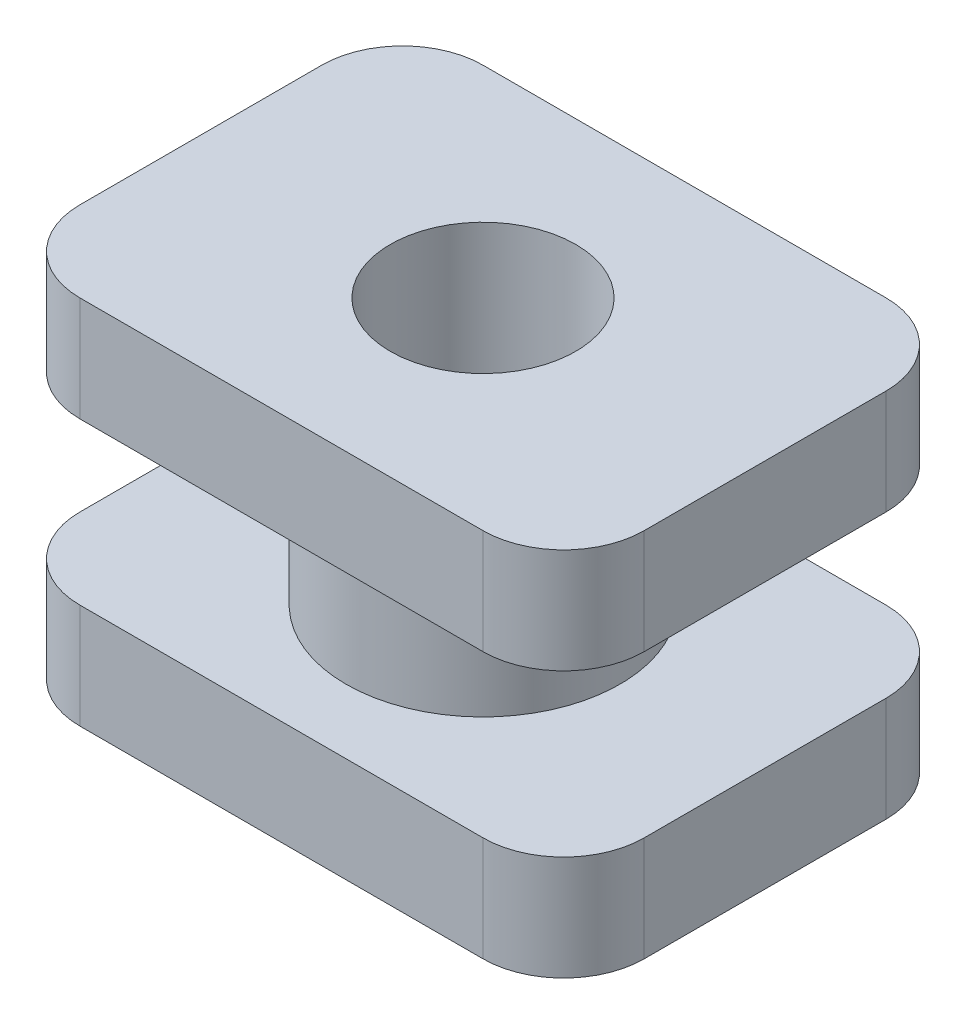
ISO-10303-21;
HEADER;
FILE_DESCRIPTION(('STEP AP214'),'2;1');
FILE_NAME('part.step','',(''),(''),'','','');
FILE_SCHEMA(('AUTOMOTIVE_DESIGN { 1 0 10303 214 1 1 1 1 }'));
ENDSEC;
DATA;
#1=APPLICATION_CONTEXT('core data for automotive mechanical design processes');
#2=APPLICATION_PROTOCOL_DEFINITION('international standard','automotive_design',2000,#1);
#3=PRODUCT_CONTEXT('',#1,'mechanical');
#4=PRODUCT('Part','Part','',(#3));
#5=PRODUCT_RELATED_PRODUCT_CATEGORY('part','',(#4));
#6=PRODUCT_DEFINITION_FORMATION('','',#4);
#7=PRODUCT_DEFINITION_CONTEXT('part definition',#1,'design');
#8=PRODUCT_DEFINITION('design','',#6,#7);
#9=PRODUCT_DEFINITION_SHAPE('','',#8);
#10=(LENGTH_UNIT() NAMED_UNIT(*) SI_UNIT(.MILLI.,.METRE.));
#11=(NAMED_UNIT(*) PLANE_ANGLE_UNIT() SI_UNIT($,.RADIAN.));
#12=(NAMED_UNIT(*) SI_UNIT($,.STERADIAN.) SOLID_ANGLE_UNIT());
#13=UNCERTAINTY_MEASURE_WITH_UNIT(LENGTH_MEASURE(1.E-05),#10,'distance_accuracy_value','');
#14=(GEOMETRIC_REPRESENTATION_CONTEXT(3) GLOBAL_UNCERTAINTY_ASSIGNED_CONTEXT((#13)) GLOBAL_UNIT_ASSIGNED_CONTEXT((#10,
#11,#12)) REPRESENTATION_CONTEXT('',''));
#15=CARTESIAN_POINT('',(0.,0.,0.));
#16=DIRECTION('',(0.,0.,1.));
#17=DIRECTION('',(1.,0.,0.));
#18=AXIS2_PLACEMENT_3D('',#15,#16,#17);
#19=CARTESIAN_POINT('',(0.,2.54,0.));
#20=DIRECTION('',(0.,-1.,0.));
#21=DIRECTION('',(0.,0.,-1.));
#22=AXIS2_PLACEMENT_3D('',#19,#20,#21);
#23=CYLINDRICAL_SURFACE('',#22,2.159);
#24=CARTESIAN_POINT('',(0.,2.54,0.));
#25=DIRECTION('',(0.,1.,0.));
#26=DIRECTION('',(0.,0.,1.));
#27=AXIS2_PLACEMENT_3D('',#24,#25,#26);
#28=CIRCLE('',#27,2.159);
#29=CARTESIAN_POINT('',(0.,2.54,2.159));
#30=VERTEX_POINT('',#29);
#31=EDGE_CURVE('E205',#30,#30,#28,.T.);
#32=ORIENTED_EDGE('',*,*,#31,.F.);
#33=EDGE_LOOP('',(#32));
#34=FACE_BOUND('',#33,.T.);
#35=CARTESIAN_POINT('',(0.,0.,0.));
#36=DIRECTION('',(0.,1.,0.));
#37=DIRECTION('',(0.,0.,1.));
#38=AXIS2_PLACEMENT_3D('',#35,#36,#37);
#39=CIRCLE('',#38,2.159);
#40=CARTESIAN_POINT('',(0.,0.,2.159));
#41=VERTEX_POINT('',#40);
#42=EDGE_CURVE('E190',#41,#41,#39,.T.);
#43=ORIENTED_EDGE('',*,*,#42,.T.);
#44=EDGE_LOOP('',(#43));
#45=FACE_BOUND('',#44,.T.);
#46=ADVANCED_FACE('F33',(#34,#45),#23,.T.);
#47=CARTESIAN_POINT('',(0.,2.54,0.));
#48=DIRECTION('',(0.,-1.,0.));
#49=DIRECTION('',(0.,0.,-1.));
#50=AXIS2_PLACEMENT_3D('',#47,#48,#49);
#51=PLANE('',#50);
#52=DIRECTION('',(0.,0.,-1.));
#53=VECTOR('',#52,1.);
#54=CARTESIAN_POINT('',(4.445,2.54,3.175));
#55=LINE('',#54,#53);
#56=CARTESIAN_POINT('',(4.445,2.54,1.905));
#57=VERTEX_POINT('',#56);
#58=CARTESIAN_POINT('',(4.445,2.54,-1.905));
#59=VERTEX_POINT('',#58);
#60=EDGE_CURVE('E193',#57,#59,#55,.T.);
#61=ORIENTED_EDGE('',*,*,#60,.F.);
#62=CARTESIAN_POINT('',(3.175,2.54,1.905));
#63=DIRECTION('',(0.,-1.,0.));
#64=DIRECTION('',(0.,0.,-1.));
#65=AXIS2_PLACEMENT_3D('',#62,#63,#64);
#66=CIRCLE('',#65,1.27);
#67=CARTESIAN_POINT('',(3.175,2.54,3.175));
#68=VERTEX_POINT('',#67);
#69=EDGE_CURVE('E254',#57,#68,#66,.T.);
#70=ORIENTED_EDGE('',*,*,#69,.T.);
#71=DIRECTION('',(1.,0.,0.));
#72=VECTOR('',#71,1.);
#73=CARTESIAN_POINT('',(-4.445,2.54,3.175));
#74=LINE('',#73,#72);
#75=CARTESIAN_POINT('',(-3.175,2.54,3.175));
#76=VERTEX_POINT('',#75);
#77=EDGE_CURVE('E198',#76,#68,#74,.T.);
#78=ORIENTED_EDGE('',*,*,#77,.F.);
#79=CARTESIAN_POINT('',(-3.175,2.54,1.905));
#80=DIRECTION('',(0.,-1.,0.));
#81=DIRECTION('',(0.,0.,-1.));
#82=AXIS2_PLACEMENT_3D('',#79,#80,#81);
#83=CIRCLE('',#82,1.27);
#84=CARTESIAN_POINT('',(-4.445,2.54,1.905));
#85=VERTEX_POINT('',#84);
#86=EDGE_CURVE('E250',#76,#85,#83,.T.);
#87=ORIENTED_EDGE('',*,*,#86,.T.);
#88=DIRECTION('',(0.,0.,1.));
#89=VECTOR('',#88,1.);
#90=CARTESIAN_POINT('',(-4.445,2.54,3.175));
#91=LINE('',#90,#89);
#92=CARTESIAN_POINT('',(-4.445,2.54,-1.905));
#93=VERTEX_POINT('',#92);
#94=EDGE_CURVE('E211',#93,#85,#91,.T.);
#95=ORIENTED_EDGE('',*,*,#94,.F.);
#96=CARTESIAN_POINT('',(-3.175,2.54,-1.905));
#97=DIRECTION('',(0.,-1.,0.));
#98=DIRECTION('',(0.,0.,-1.));
#99=AXIS2_PLACEMENT_3D('',#96,#97,#98);
#100=CIRCLE('',#99,1.27);
#101=CARTESIAN_POINT('',(-3.175,2.54,-3.175));
#102=VERTEX_POINT('',#101);
#103=EDGE_CURVE('E248',#93,#102,#100,.T.);
#104=ORIENTED_EDGE('',*,*,#103,.T.);
#105=DIRECTION('',(-1.,0.,0.));
#106=VECTOR('',#105,1.);
#107=CARTESIAN_POINT('',(-4.445,2.54,-3.175));
#108=LINE('',#107,#106);
#109=CARTESIAN_POINT('',(3.175,2.54,-3.175));
#110=VERTEX_POINT('',#109);
#111=EDGE_CURVE('E208',#110,#102,#108,.T.);
#112=ORIENTED_EDGE('',*,*,#111,.F.);
#113=CARTESIAN_POINT('',(3.175,2.54,-1.905));
#114=DIRECTION('',(0.,-1.,0.));
#115=DIRECTION('',(0.,0.,-1.));
#116=AXIS2_PLACEMENT_3D('',#113,#114,#115);
#117=CIRCLE('',#116,1.27);
#118=EDGE_CURVE('E252',#110,#59,#117,.T.);
#119=ORIENTED_EDGE('',*,*,#118,.T.);
#120=EDGE_LOOP('',(#61,#70,#78,#87,#95,#104,#112,#119));
#121=FACE_BOUND('',#120,.T.);
#122=ORIENTED_EDGE('',*,*,#31,.T.);
#123=EDGE_LOOP('',(#122));
#124=FACE_BOUND('',#123,.T.);
#125=ADVANCED_FACE('F279',(#121,#124),#51,.T.);
#126=CARTESIAN_POINT('',(4.445,4.191,3.175));
#127=DIRECTION('',(-1.,0.,0.));
#128=DIRECTION('',(0.,0.,1.));
#129=AXIS2_PLACEMENT_3D('',#126,#127,#128);
#130=PLANE('',#129);
#131=DIRECTION('',(0.,0.,-1.));
#132=VECTOR('',#131,1.);
#133=CARTESIAN_POINT('',(4.445,4.191,3.175));
#134=LINE('',#133,#132);
#135=CARTESIAN_POINT('',(4.445,4.191,1.905));
#136=VERTEX_POINT('',#135);
#137=CARTESIAN_POINT('',(4.445,4.191,-1.905));
#138=VERTEX_POINT('',#137);
#139=EDGE_CURVE('E194',#136,#138,#134,.T.);
#140=ORIENTED_EDGE('',*,*,#139,.F.);
#141=DIRECTION('',(0.,-1.,0.));
#142=VECTOR('',#141,1.);
#143=CARTESIAN_POINT('',(4.445,4.191,1.905));
#144=LINE('',#143,#142);
#145=EDGE_CURVE('E245',#136,#57,#144,.T.);
#146=ORIENTED_EDGE('',*,*,#145,.T.);
#147=ORIENTED_EDGE('',*,*,#60,.T.);
#148=DIRECTION('',(0.,-1.,0.));
#149=VECTOR('',#148,1.);
#150=CARTESIAN_POINT('',(4.445,4.191,-1.905));
#151=LINE('',#150,#149);
#152=EDGE_CURVE('E243',#59,#138,#151,.F.);
#153=ORIENTED_EDGE('',*,*,#152,.T.);
#154=EDGE_LOOP('',(#140,#146,#147,#153));
#155=FACE_BOUND('',#154,.T.);
#156=ADVANCED_FACE('F298',(#155),#130,.F.);
#157=CARTESIAN_POINT('',(-4.445,4.191,-3.175));
#158=DIRECTION('',(0.,0.,1.));
#159=DIRECTION('',(1.,0.,0.));
#160=AXIS2_PLACEMENT_3D('',#157,#158,#159);
#161=PLANE('',#160);
#162=DIRECTION('',(-1.,0.,0.));
#163=VECTOR('',#162,1.);
#164=CARTESIAN_POINT('',(-4.445,4.191,-3.175));
#165=LINE('',#164,#163);
#166=CARTESIAN_POINT('',(3.175,4.191,-3.175));
#167=VERTEX_POINT('',#166);
#168=CARTESIAN_POINT('',(-3.175,4.191,-3.175));
#169=VERTEX_POINT('',#168);
#170=EDGE_CURVE('E197',#167,#169,#165,.T.);
#171=ORIENTED_EDGE('',*,*,#170,.F.);
#172=DIRECTION('',(0.,-1.,0.));
#173=VECTOR('',#172,1.);
#174=CARTESIAN_POINT('',(3.175,4.191,-3.175));
#175=LINE('',#174,#173);
#176=EDGE_CURVE('E270',#167,#110,#175,.T.);
#177=ORIENTED_EDGE('',*,*,#176,.T.);
#178=ORIENTED_EDGE('',*,*,#111,.T.);
#179=DIRECTION('',(0.,-1.,0.));
#180=VECTOR('',#179,1.);
#181=CARTESIAN_POINT('',(-3.175,4.191,-3.175));
#182=LINE('',#181,#180);
#183=EDGE_CURVE('E268',#102,#169,#182,.F.);
#184=ORIENTED_EDGE('',*,*,#183,.T.);
#185=EDGE_LOOP('',(#171,#177,#178,#184));
#186=FACE_BOUND('',#185,.T.);
#187=ADVANCED_FACE('F306',(#186),#161,.F.);
#188=CARTESIAN_POINT('',(-4.445,4.191,3.175));
#189=DIRECTION('',(1.,0.,0.));
#190=DIRECTION('',(0.,0.,-1.));
#191=AXIS2_PLACEMENT_3D('',#188,#189,#190);
#192=PLANE('',#191);
#193=ORIENTED_EDGE('',*,*,#94,.T.);
#194=DIRECTION('',(0.,-1.,0.));
#195=VECTOR('',#194,1.);
#196=CARTESIAN_POINT('',(-4.445,4.191,1.905));
#197=LINE('',#196,#195);
#198=CARTESIAN_POINT('',(-4.445,4.191,1.905));
#199=VERTEX_POINT('',#198);
#200=EDGE_CURVE('E11',#85,#199,#197,.F.);
#201=ORIENTED_EDGE('',*,*,#200,.T.);
#202=DIRECTION('',(0.,0.,1.));
#203=VECTOR('',#202,1.);
#204=CARTESIAN_POINT('',(-4.445,4.191,3.175));
#205=LINE('',#204,#203);
#206=CARTESIAN_POINT('',(-4.445,4.191,-1.905));
#207=VERTEX_POINT('',#206);
#208=EDGE_CURVE('E200',#207,#199,#205,.T.);
#209=ORIENTED_EDGE('',*,*,#208,.F.);
#210=DIRECTION('',(0.,-1.,0.));
#211=VECTOR('',#210,1.);
#212=CARTESIAN_POINT('',(-4.445,4.191,-1.905));
#213=LINE('',#212,#211);
#214=EDGE_CURVE('E41',#207,#93,#213,.T.);
#215=ORIENTED_EDGE('',*,*,#214,.T.);
#216=EDGE_LOOP('',(#193,#201,#209,#215));
#217=FACE_BOUND('',#216,.T.);
#218=ADVANCED_FACE('F275',(#217),#192,.F.);
#219=CARTESIAN_POINT('',(-4.445,4.191,3.175));
#220=DIRECTION('',(0.,0.,-1.));
#221=DIRECTION('',(-1.,0.,0.));
#222=AXIS2_PLACEMENT_3D('',#219,#220,#221);
#223=PLANE('',#222);
#224=ORIENTED_EDGE('',*,*,#77,.T.);
#225=DIRECTION('',(0.,-1.,0.));
#226=VECTOR('',#225,1.);
#227=CARTESIAN_POINT('',(3.175,4.191,3.175));
#228=LINE('',#227,#226);
#229=CARTESIAN_POINT('',(3.175,4.191,3.175));
#230=VERTEX_POINT('',#229);
#231=EDGE_CURVE('E259',#68,#230,#228,.F.);
#232=ORIENTED_EDGE('',*,*,#231,.T.);
#233=DIRECTION('',(1.,0.,0.));
#234=VECTOR('',#233,1.);
#235=CARTESIAN_POINT('',(-4.445,4.191,3.175));
#236=LINE('',#235,#234);
#237=CARTESIAN_POINT('',(-3.175,4.191,3.175));
#238=VERTEX_POINT('',#237);
#239=EDGE_CURVE('E202',#238,#230,#236,.T.);
#240=ORIENTED_EDGE('',*,*,#239,.F.);
#241=DIRECTION('',(0.,-1.,0.));
#242=VECTOR('',#241,1.);
#243=CARTESIAN_POINT('',(-3.175,4.191,3.175));
#244=LINE('',#243,#242);
#245=EDGE_CURVE('E256',#238,#76,#244,.T.);
#246=ORIENTED_EDGE('',*,*,#245,.T.);
#247=EDGE_LOOP('',(#224,#232,#240,#246));
#248=FACE_BOUND('',#247,.T.);
#249=ADVANCED_FACE('F289',(#248),#223,.F.);
#250=CARTESIAN_POINT('',(0.,4.191,0.));
#251=DIRECTION('',(0.,-1.,0.));
#252=DIRECTION('',(0.,0.,-1.));
#253=AXIS2_PLACEMENT_3D('',#250,#251,#252);
#254=PLANE('',#253);
#255=CARTESIAN_POINT('',(0.,4.191,0.));
#256=DIRECTION('',(0.,1.,0.));
#257=DIRECTION('',(0.,0.,1.));
#258=AXIS2_PLACEMENT_3D('',#255,#256,#257);
#259=CIRCLE('',#258,1.4605);
#260=CARTESIAN_POINT('',(0.,4.191,1.4605));
#261=VERTEX_POINT('',#260);
#262=EDGE_CURVE('E180',#261,#261,#259,.T.);
#263=ORIENTED_EDGE('',*,*,#262,.F.);
#264=EDGE_LOOP('',(#263));
#265=FACE_BOUND('',#264,.T.);
#266=ORIENTED_EDGE('',*,*,#239,.T.);
#267=CARTESIAN_POINT('',(3.175,4.191,1.905));
#268=DIRECTION('',(0.,-1.,0.));
#269=DIRECTION('',(0.,0.,-1.));
#270=AXIS2_PLACEMENT_3D('',#267,#268,#269);
#271=CIRCLE('',#270,1.27);
#272=EDGE_CURVE('E266',#230,#136,#271,.F.);
#273=ORIENTED_EDGE('',*,*,#272,.T.);
#274=ORIENTED_EDGE('',*,*,#139,.T.);
#275=CARTESIAN_POINT('',(3.175,4.191,-1.905));
#276=DIRECTION('',(0.,-1.,0.));
#277=DIRECTION('',(0.,0.,-1.));
#278=AXIS2_PLACEMENT_3D('',#275,#276,#277);
#279=CIRCLE('',#278,1.27);
#280=EDGE_CURVE('E264',#138,#167,#279,.F.);
#281=ORIENTED_EDGE('',*,*,#280,.T.);
#282=ORIENTED_EDGE('',*,*,#170,.T.);
#283=CARTESIAN_POINT('',(-3.175,4.191,-1.905));
#284=DIRECTION('',(0.,-1.,0.));
#285=DIRECTION('',(0.,0.,-1.));
#286=AXIS2_PLACEMENT_3D('',#283,#284,#285);
#287=CIRCLE('',#286,1.27);
#288=EDGE_CURVE('E53',#169,#207,#287,.F.);
#289=ORIENTED_EDGE('',*,*,#288,.T.);
#290=ORIENTED_EDGE('',*,*,#208,.T.);
#291=CARTESIAN_POINT('',(-3.175,4.191,1.905));
#292=DIRECTION('',(0.,-1.,0.));
#293=DIRECTION('',(0.,0.,-1.));
#294=AXIS2_PLACEMENT_3D('',#291,#292,#293);
#295=CIRCLE('',#294,1.27);
#296=EDGE_CURVE('E262',#199,#238,#295,.F.);
#297=ORIENTED_EDGE('',*,*,#296,.T.);
#298=EDGE_LOOP('',(#266,#273,#274,#281,#282,#289,#290,#297));
#299=FACE_BOUND('',#298,.T.);
#300=ADVANCED_FACE('F292',(#265,#299),#254,.F.);
#301=CARTESIAN_POINT('',(0.,0.,0.));
#302=DIRECTION('',(0.,1.,0.));
#303=DIRECTION('',(0.,0.,1.));
#304=AXIS2_PLACEMENT_3D('',#301,#302,#303);
#305=PLANE('',#304);
#306=DIRECTION('',(0.,0.,-1.));
#307=VECTOR('',#306,1.);
#308=CARTESIAN_POINT('',(-4.445,0.,3.175));
#309=LINE('',#308,#307);
#310=CARTESIAN_POINT('',(-4.445,0.,1.905));
#311=VERTEX_POINT('',#310);
#312=CARTESIAN_POINT('',(-4.445,0.,-1.905));
#313=VERTEX_POINT('',#312);
#314=EDGE_CURVE('E163',#311,#313,#309,.T.);
#315=ORIENTED_EDGE('',*,*,#314,.F.);
#316=CARTESIAN_POINT('',(-3.175,0.,1.905));
#317=DIRECTION('',(0.,1.,0.));
#318=DIRECTION('',(0.,0.,1.));
#319=AXIS2_PLACEMENT_3D('',#316,#317,#318);
#320=CIRCLE('',#319,1.27);
#321=CARTESIAN_POINT('',(-3.175,0.,3.175));
#322=VERTEX_POINT('',#321);
#323=EDGE_CURVE('E146',#311,#322,#320,.T.);
#324=ORIENTED_EDGE('',*,*,#323,.T.);
#325=DIRECTION('',(-1.,0.,0.));
#326=VECTOR('',#325,1.);
#327=CARTESIAN_POINT('',(4.445,0.,3.175));
#328=LINE('',#327,#326);
#329=CARTESIAN_POINT('',(3.175,0.,3.175));
#330=VERTEX_POINT('',#329);
#331=EDGE_CURVE('E188',#330,#322,#328,.T.);
#332=ORIENTED_EDGE('',*,*,#331,.F.);
#333=CARTESIAN_POINT('',(3.175,0.,1.905));
#334=DIRECTION('',(0.,1.,0.));
#335=DIRECTION('',(0.,0.,1.));
#336=AXIS2_PLACEMENT_3D('',#333,#334,#335);
#337=CIRCLE('',#336,1.27);
#338=CARTESIAN_POINT('',(4.445,0.,1.905));
#339=VERTEX_POINT('',#338);
#340=EDGE_CURVE('E167',#330,#339,#337,.T.);
#341=ORIENTED_EDGE('',*,*,#340,.T.);
#342=DIRECTION('',(0.,0.,1.));
#343=VECTOR('',#342,1.);
#344=CARTESIAN_POINT('',(4.445,0.,3.175));
#345=LINE('',#344,#343);
#346=CARTESIAN_POINT('',(4.445,0.,-1.905));
#347=VERTEX_POINT('',#346);
#348=EDGE_CURVE('E177',#347,#339,#345,.T.);
#349=ORIENTED_EDGE('',*,*,#348,.F.);
#350=CARTESIAN_POINT('',(3.175,0.,-1.905));
#351=DIRECTION('',(0.,1.,0.));
#352=DIRECTION('',(0.,0.,1.));
#353=AXIS2_PLACEMENT_3D('',#350,#351,#352);
#354=CIRCLE('',#353,1.27);
#355=CARTESIAN_POINT('',(3.175,0.,-3.175));
#356=VERTEX_POINT('',#355);
#357=EDGE_CURVE('E219',#347,#356,#354,.T.);
#358=ORIENTED_EDGE('',*,*,#357,.T.);
#359=DIRECTION('',(1.,0.,0.));
#360=VECTOR('',#359,1.);
#361=CARTESIAN_POINT('',(4.445,0.,-3.175));
#362=LINE('',#361,#360);
#363=CARTESIAN_POINT('',(-3.175,0.,-3.175));
#364=VERTEX_POINT('',#363);
#365=EDGE_CURVE('E173',#364,#356,#362,.T.);
#366=ORIENTED_EDGE('',*,*,#365,.F.);
#367=CARTESIAN_POINT('',(-3.175,0.,-1.905));
#368=DIRECTION('',(0.,1.,0.));
#369=DIRECTION('',(0.,0.,1.));
#370=AXIS2_PLACEMENT_3D('',#367,#368,#369);
#371=CIRCLE('',#370,1.27);
#372=EDGE_CURVE('E157',#364,#313,#371,.T.);
#373=ORIENTED_EDGE('',*,*,#372,.T.);
#374=EDGE_LOOP('',(#315,#324,#332,#341,#349,#358,#366,#373));
#375=FACE_BOUND('',#374,.T.);
#376=ORIENTED_EDGE('',*,*,#42,.F.);
#377=EDGE_LOOP('',(#376));
#378=FACE_BOUND('',#377,.T.);
#379=ADVANCED_FACE('F170',(#375,#378),#305,.T.);
#380=CARTESIAN_POINT('',(-4.445,-1.651,3.175));
#381=DIRECTION('',(1.,0.,0.));
#382=DIRECTION('',(0.,0.,-1.));
#383=AXIS2_PLACEMENT_3D('',#380,#381,#382);
#384=PLANE('',#383);
#385=DIRECTION('',(0.,0.,-1.));
#386=VECTOR('',#385,1.);
#387=CARTESIAN_POINT('',(-4.445,-1.651,3.175));
#388=LINE('',#387,#386);
#389=CARTESIAN_POINT('',(-4.445,-1.651,1.905));
#390=VERTEX_POINT('',#389);
#391=CARTESIAN_POINT('',(-4.445,-1.651,-1.905));
#392=VERTEX_POINT('',#391);
#393=EDGE_CURVE('E166',#390,#392,#388,.T.);
#394=ORIENTED_EDGE('',*,*,#393,.F.);
#395=DIRECTION('',(0.,1.,0.));
#396=VECTOR('',#395,1.);
#397=CARTESIAN_POINT('',(-4.445,-1.651,1.905));
#398=LINE('',#397,#396);
#399=EDGE_CURVE('E150',#390,#311,#398,.T.);
#400=ORIENTED_EDGE('',*,*,#399,.T.);
#401=ORIENTED_EDGE('',*,*,#314,.T.);
#402=DIRECTION('',(0.,1.,0.));
#403=VECTOR('',#402,1.);
#404=CARTESIAN_POINT('',(-4.445,-1.651,-1.905));
#405=LINE('',#404,#403);
#406=EDGE_CURVE('E168',#313,#392,#405,.F.);
#407=ORIENTED_EDGE('',*,*,#406,.T.);
#408=EDGE_LOOP('',(#394,#400,#401,#407));
#409=FACE_BOUND('',#408,.T.);
#410=ADVANCED_FACE('F162',(#409),#384,.F.);
#411=CARTESIAN_POINT('',(4.445,-1.651,-3.175));
#412=DIRECTION('',(0.,0.,1.));
#413=DIRECTION('',(1.,0.,0.));
#414=AXIS2_PLACEMENT_3D('',#411,#412,#413);
#415=PLANE('',#414);
#416=DIRECTION('',(1.,0.,0.));
#417=VECTOR('',#416,1.);
#418=CARTESIAN_POINT('',(4.445,-1.651,-3.175));
#419=LINE('',#418,#417);
#420=CARTESIAN_POINT('',(-3.175,-1.651,-3.175));
#421=VERTEX_POINT('',#420);
#422=CARTESIAN_POINT('',(3.175,-1.651,-3.175));
#423=VERTEX_POINT('',#422);
#424=EDGE_CURVE('E508',#421,#423,#419,.T.);
#425=ORIENTED_EDGE('',*,*,#424,.F.);
#426=DIRECTION('',(0.,1.,0.));
#427=VECTOR('',#426,1.);
#428=CARTESIAN_POINT('',(-3.175,-1.651,-3.175));
#429=LINE('',#428,#427);
#430=EDGE_CURVE('E235',#421,#364,#429,.T.);
#431=ORIENTED_EDGE('',*,*,#430,.T.);
#432=ORIENTED_EDGE('',*,*,#365,.T.);
#433=DIRECTION('',(0.,1.,0.));
#434=VECTOR('',#433,1.);
#435=CARTESIAN_POINT('',(3.175,-1.651,-3.175));
#436=LINE('',#435,#434);
#437=EDGE_CURVE('E233',#356,#423,#436,.F.);
#438=ORIENTED_EDGE('',*,*,#437,.T.);
#439=EDGE_LOOP('',(#425,#431,#432,#438));
#440=FACE_BOUND('',#439,.T.);
#441=ADVANCED_FACE('F418',(#440),#415,.F.);
#442=CARTESIAN_POINT('',(4.445,-1.651,3.175));
#443=DIRECTION('',(-1.,0.,0.));
#444=DIRECTION('',(0.,0.,1.));
#445=AXIS2_PLACEMENT_3D('',#442,#443,#444);
#446=PLANE('',#445);
#447=DIRECTION('',(0.,0.,1.));
#448=VECTOR('',#447,1.);
#449=CARTESIAN_POINT('',(4.445,-1.651,3.175));
#450=LINE('',#449,#448);
#451=CARTESIAN_POINT('',(4.445,-1.651,-1.905));
#452=VERTEX_POINT('',#451);
#453=CARTESIAN_POINT('',(4.445,-1.651,1.905));
#454=VERTEX_POINT('',#453);
#455=EDGE_CURVE('E510',#452,#454,#450,.T.);
#456=ORIENTED_EDGE('',*,*,#455,.F.);
#457=DIRECTION('',(0.,1.,0.));
#458=VECTOR('',#457,1.);
#459=CARTESIAN_POINT('',(4.445,-1.651,-1.905));
#460=LINE('',#459,#458);
#461=EDGE_CURVE('E240',#452,#347,#460,.T.);
#462=ORIENTED_EDGE('',*,*,#461,.T.);
#463=ORIENTED_EDGE('',*,*,#348,.T.);
#464=DIRECTION('',(0.,1.,0.));
#465=VECTOR('',#464,1.);
#466=CARTESIAN_POINT('',(4.445,-1.651,1.905));
#467=LINE('',#466,#465);
#468=EDGE_CURVE('E238',#339,#454,#467,.F.);
#469=ORIENTED_EDGE('',*,*,#468,.T.);
#470=EDGE_LOOP('',(#456,#462,#463,#469));
#471=FACE_BOUND('',#470,.T.);
#472=ADVANCED_FACE('F409',(#471),#446,.F.);
#473=CARTESIAN_POINT('',(4.445,-1.651,3.175));
#474=DIRECTION('',(0.,0.,-1.));
#475=DIRECTION('',(-1.,0.,0.));
#476=AXIS2_PLACEMENT_3D('',#473,#474,#475);
#477=PLANE('',#476);
#478=ORIENTED_EDGE('',*,*,#331,.T.);
#479=DIRECTION('',(0.,1.,0.));
#480=VECTOR('',#479,1.);
#481=CARTESIAN_POINT('',(-3.175,-1.651,3.175));
#482=LINE('',#481,#480);
#483=CARTESIAN_POINT('',(-3.175,-1.651,3.175));
#484=VERTEX_POINT('',#483);
#485=EDGE_CURVE('E151',#322,#484,#482,.F.);
#486=ORIENTED_EDGE('',*,*,#485,.T.);
#487=DIRECTION('',(-1.,0.,0.));
#488=VECTOR('',#487,1.);
#489=CARTESIAN_POINT('',(4.445,-1.651,3.175));
#490=LINE('',#489,#488);
#491=CARTESIAN_POINT('',(3.175,-1.651,3.175));
#492=VERTEX_POINT('',#491);
#493=EDGE_CURVE('E183',#492,#484,#490,.T.);
#494=ORIENTED_EDGE('',*,*,#493,.F.);
#495=DIRECTION('',(0.,1.,0.));
#496=VECTOR('',#495,1.);
#497=CARTESIAN_POINT('',(3.175,-1.651,3.175));
#498=LINE('',#497,#496);
#499=EDGE_CURVE('E156',#492,#330,#498,.T.);
#500=ORIENTED_EDGE('',*,*,#499,.T.);
#501=EDGE_LOOP('',(#478,#486,#494,#500));
#502=FACE_BOUND('',#501,.T.);
#503=ADVANCED_FACE('F400',(#502),#477,.F.);
#504=CARTESIAN_POINT('',(0.,-1.651,0.));
#505=DIRECTION('',(0.,1.,0.));
#506=DIRECTION('',(0.,0.,1.));
#507=AXIS2_PLACEMENT_3D('',#504,#505,#506);
#508=PLANE('',#507);
#509=CARTESIAN_POINT('',(0.,-1.651,0.));
#510=DIRECTION('',(0.,1.,0.));
#511=DIRECTION('',(0.,0.,1.));
#512=AXIS2_PLACEMENT_3D('',#509,#510,#511);
#513=CIRCLE('',#512,1.4605);
#514=CARTESIAN_POINT('',(0.,-1.651,1.4605));
#515=VERTEX_POINT('',#514);
#516=EDGE_CURVE('E174',#515,#515,#513,.T.);
#517=ORIENTED_EDGE('',*,*,#516,.T.);
#518=EDGE_LOOP('',(#517));
#519=FACE_BOUND('',#518,.T.);
#520=ORIENTED_EDGE('',*,*,#493,.T.);
#521=CARTESIAN_POINT('',(-3.175,-1.651,1.905));
#522=DIRECTION('',(0.,1.,0.));
#523=DIRECTION('',(0.,0.,1.));
#524=AXIS2_PLACEMENT_3D('',#521,#522,#523);
#525=CIRCLE('',#524,1.27);
#526=EDGE_CURVE('E231',#484,#390,#525,.F.);
#527=ORIENTED_EDGE('',*,*,#526,.T.);
#528=ORIENTED_EDGE('',*,*,#393,.T.);
#529=CARTESIAN_POINT('',(-3.175,-1.651,-1.905));
#530=DIRECTION('',(0.,1.,0.));
#531=DIRECTION('',(0.,0.,1.));
#532=AXIS2_PLACEMENT_3D('',#529,#530,#531);
#533=CIRCLE('',#532,1.27);
#534=EDGE_CURVE('E229',#392,#421,#533,.F.);
#535=ORIENTED_EDGE('',*,*,#534,.T.);
#536=ORIENTED_EDGE('',*,*,#424,.T.);
#537=CARTESIAN_POINT('',(3.175,-1.651,-1.905));
#538=DIRECTION('',(0.,1.,0.));
#539=DIRECTION('',(0.,0.,1.));
#540=AXIS2_PLACEMENT_3D('',#537,#538,#539);
#541=CIRCLE('',#540,1.27);
#542=EDGE_CURVE('E227',#423,#452,#541,.F.);
#543=ORIENTED_EDGE('',*,*,#542,.T.);
#544=ORIENTED_EDGE('',*,*,#455,.T.);
#545=CARTESIAN_POINT('',(3.175,-1.651,1.905));
#546=DIRECTION('',(0.,1.,0.));
#547=DIRECTION('',(0.,0.,1.));
#548=AXIS2_PLACEMENT_3D('',#545,#546,#547);
#549=CIRCLE('',#548,1.27);
#550=EDGE_CURVE('E225',#454,#492,#549,.F.);
#551=ORIENTED_EDGE('',*,*,#550,.T.);
#552=EDGE_LOOP('',(#520,#527,#528,#535,#536,#543,#544,#551));
#553=FACE_BOUND('',#552,.T.);
#554=ADVANCED_FACE('F391',(#519,#553),#508,.F.);
#555=CARTESIAN_POINT('',(0.,-1.651,0.));
#556=DIRECTION('',(0.,1.,0.));
#557=DIRECTION('',(0.,0.,1.));
#558=AXIS2_PLACEMENT_3D('',#555,#556,#557);
#559=CYLINDRICAL_SURFACE('',#558,1.4605);
#560=ORIENTED_EDGE('',*,*,#516,.F.);
#561=EDGE_LOOP('',(#560));
#562=FACE_BOUND('',#561,.T.);
#563=ORIENTED_EDGE('',*,*,#262,.T.);
#564=EDGE_LOOP('',(#563));
#565=FACE_BOUND('',#564,.T.);
#566=ADVANCED_FACE('F327',(#562,#565),#559,.F.);
#567=CARTESIAN_POINT('',(-3.175,-1.651,1.905));
#568=DIRECTION('',(0.,1.,0.));
#569=DIRECTION('',(0.,0.,1.));
#570=AXIS2_PLACEMENT_3D('',#567,#568,#569);
#571=CYLINDRICAL_SURFACE('',#570,1.27);
#572=ORIENTED_EDGE('',*,*,#526,.F.);
#573=ORIENTED_EDGE('',*,*,#485,.F.);
#574=ORIENTED_EDGE('',*,*,#323,.F.);
#575=ORIENTED_EDGE('',*,*,#399,.F.);
#576=EDGE_LOOP('',(#572,#573,#574,#575));
#577=FACE_BOUND('',#576,.T.);
#578=ADVANCED_FACE('F149',(#577),#571,.T.);
#579=CARTESIAN_POINT('',(-3.175,-1.651,-1.905));
#580=DIRECTION('',(0.,1.,0.));
#581=DIRECTION('',(0.,0.,1.));
#582=AXIS2_PLACEMENT_3D('',#579,#580,#581);
#583=CYLINDRICAL_SURFACE('',#582,1.27);
#584=ORIENTED_EDGE('',*,*,#534,.F.);
#585=ORIENTED_EDGE('',*,*,#406,.F.);
#586=ORIENTED_EDGE('',*,*,#372,.F.);
#587=ORIENTED_EDGE('',*,*,#430,.F.);
#588=EDGE_LOOP('',(#584,#585,#586,#587));
#589=FACE_BOUND('',#588,.T.);
#590=ADVANCED_FACE('F326',(#589),#583,.T.);
#591=CARTESIAN_POINT('',(3.175,-1.651,-1.905));
#592=DIRECTION('',(0.,1.,0.));
#593=DIRECTION('',(0.,0.,1.));
#594=AXIS2_PLACEMENT_3D('',#591,#592,#593);
#595=CYLINDRICAL_SURFACE('',#594,1.27);
#596=ORIENTED_EDGE('',*,*,#542,.F.);
#597=ORIENTED_EDGE('',*,*,#437,.F.);
#598=ORIENTED_EDGE('',*,*,#357,.F.);
#599=ORIENTED_EDGE('',*,*,#461,.F.);
#600=EDGE_LOOP('',(#596,#597,#598,#599));
#601=FACE_BOUND('',#600,.T.);
#602=ADVANCED_FACE('F330',(#601),#595,.T.);
#603=CARTESIAN_POINT('',(3.175,-1.651,1.905));
#604=DIRECTION('',(0.,1.,0.));
#605=DIRECTION('',(0.,0.,1.));
#606=AXIS2_PLACEMENT_3D('',#603,#604,#605);
#607=CYLINDRICAL_SURFACE('',#606,1.27);
#608=ORIENTED_EDGE('',*,*,#550,.F.);
#609=ORIENTED_EDGE('',*,*,#468,.F.);
#610=ORIENTED_EDGE('',*,*,#340,.F.);
#611=ORIENTED_EDGE('',*,*,#499,.F.);
#612=EDGE_LOOP('',(#608,#609,#610,#611));
#613=FACE_BOUND('',#612,.T.);
#614=ADVANCED_FACE('F334',(#613),#607,.T.);
#615=CARTESIAN_POINT('',(3.175,4.191,1.905));
#616=DIRECTION('',(0.,-1.,0.));
#617=DIRECTION('',(0.,0.,-1.));
#618=AXIS2_PLACEMENT_3D('',#615,#616,#617);
#619=CYLINDRICAL_SURFACE('',#618,1.27);
#620=ORIENTED_EDGE('',*,*,#272,.F.);
#621=ORIENTED_EDGE('',*,*,#231,.F.);
#622=ORIENTED_EDGE('',*,*,#69,.F.);
#623=ORIENTED_EDGE('',*,*,#145,.F.);
#624=EDGE_LOOP('',(#620,#621,#622,#623));
#625=FACE_BOUND('',#624,.T.);
#626=ADVANCED_FACE('F296',(#625),#619,.T.);
#627=CARTESIAN_POINT('',(3.175,4.191,-1.905));
#628=DIRECTION('',(0.,-1.,0.));
#629=DIRECTION('',(0.,0.,-1.));
#630=AXIS2_PLACEMENT_3D('',#627,#628,#629);
#631=CYLINDRICAL_SURFACE('',#630,1.27);
#632=ORIENTED_EDGE('',*,*,#280,.F.);
#633=ORIENTED_EDGE('',*,*,#152,.F.);
#634=ORIENTED_EDGE('',*,*,#118,.F.);
#635=ORIENTED_EDGE('',*,*,#176,.F.);
#636=EDGE_LOOP('',(#632,#633,#634,#635));
#637=FACE_BOUND('',#636,.T.);
#638=ADVANCED_FACE('F303',(#637),#631,.T.);
#639=CARTESIAN_POINT('',(-3.175,4.191,1.905));
#640=DIRECTION('',(0.,-1.,0.));
#641=DIRECTION('',(0.,0.,-1.));
#642=AXIS2_PLACEMENT_3D('',#639,#640,#641);
#643=CYLINDRICAL_SURFACE('',#642,1.27);
#644=ORIENTED_EDGE('',*,*,#296,.F.);
#645=ORIENTED_EDGE('',*,*,#200,.F.);
#646=ORIENTED_EDGE('',*,*,#86,.F.);
#647=ORIENTED_EDGE('',*,*,#245,.F.);
#648=EDGE_LOOP('',(#644,#645,#646,#647));
#649=FACE_BOUND('',#648,.T.);
#650=ADVANCED_FACE('F286',(#649),#643,.T.);
#651=CARTESIAN_POINT('',(-3.175,4.191,-1.905));
#652=DIRECTION('',(0.,-1.,0.));
#653=DIRECTION('',(0.,0.,-1.));
#654=AXIS2_PLACEMENT_3D('',#651,#652,#653);
#655=CYLINDRICAL_SURFACE('',#654,1.27);
#656=ORIENTED_EDGE('',*,*,#288,.F.);
#657=ORIENTED_EDGE('',*,*,#183,.F.);
#658=ORIENTED_EDGE('',*,*,#103,.F.);
#659=ORIENTED_EDGE('',*,*,#214,.F.);
#660=EDGE_LOOP('',(#656,#657,#658,#659));
#661=FACE_BOUND('',#660,.T.);
#662=ADVANCED_FACE('F35',(#661),#655,.T.);
#663=CLOSED_SHELL('',(#46,#125,#156,#187,#218,#249,#300,#379,#410,#441,#472,#503,#554,#566,#578,
#590,#602,#614,#626,#638,#650,#662));
#664=MANIFOLD_SOLID_BREP('B2',#663);
#665=ADVANCED_BREP_SHAPE_REPRESENTATION('',(#18,#664),#14);
#666=SHAPE_DEFINITION_REPRESENTATION(#9,#665);
ENDSEC;
END-ISO-10303-21;
